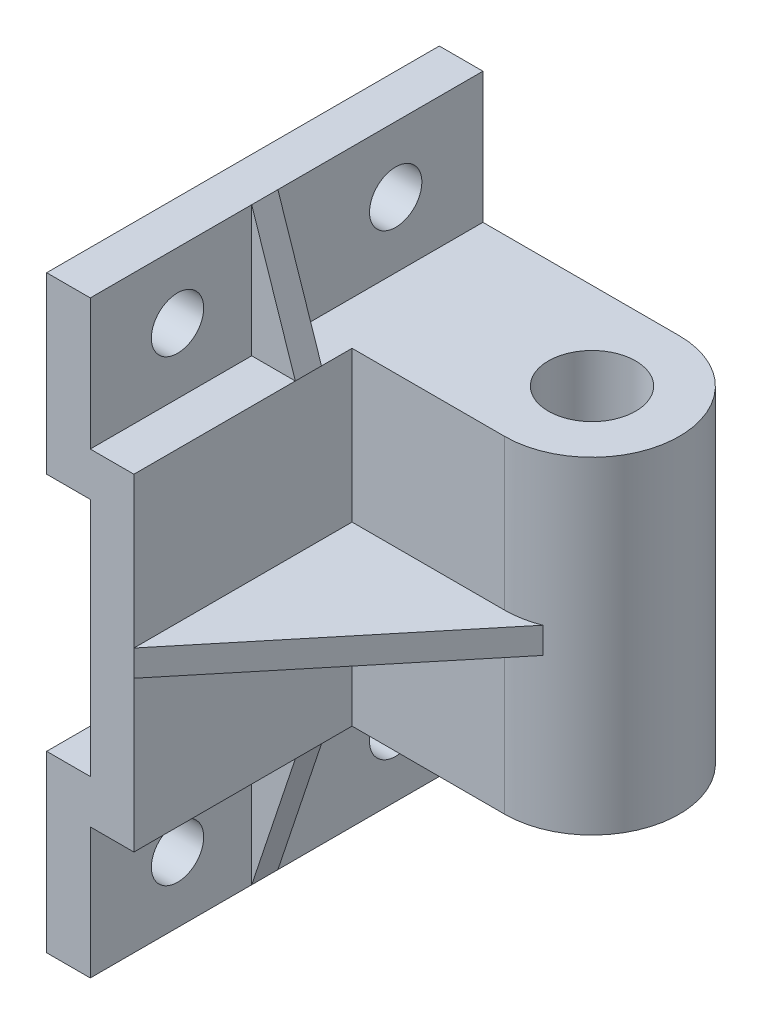
ISO-10303-21;
HEADER;
FILE_DESCRIPTION(('STEP AP214'),'2;1');
FILE_NAME('part.step','',(''),(''),'','','');
FILE_SCHEMA(('AUTOMOTIVE_DESIGN { 1 0 10303 214 1 1 1 1 }'));
ENDSEC;
DATA;
#1=APPLICATION_CONTEXT('core data for automotive mechanical design processes');
#2=APPLICATION_PROTOCOL_DEFINITION('international standard','automotive_design',2000,#1);
#3=PRODUCT_CONTEXT('',#1,'mechanical');
#4=PRODUCT('Part','Part','',(#3));
#5=PRODUCT_RELATED_PRODUCT_CATEGORY('part','',(#4));
#6=PRODUCT_DEFINITION_FORMATION('','',#4);
#7=PRODUCT_DEFINITION_CONTEXT('part definition',#1,'design');
#8=PRODUCT_DEFINITION('design','',#6,#7);
#9=PRODUCT_DEFINITION_SHAPE('','',#8);
#10=(LENGTH_UNIT() NAMED_UNIT(*) SI_UNIT(.MILLI.,.METRE.));
#11=(NAMED_UNIT(*) PLANE_ANGLE_UNIT() SI_UNIT($,.RADIAN.));
#12=(NAMED_UNIT(*) SI_UNIT($,.STERADIAN.) SOLID_ANGLE_UNIT());
#13=UNCERTAINTY_MEASURE_WITH_UNIT(LENGTH_MEASURE(1.E-05),#10,'distance_accuracy_value','');
#14=(GEOMETRIC_REPRESENTATION_CONTEXT(3) GLOBAL_UNCERTAINTY_ASSIGNED_CONTEXT((#13)) GLOBAL_UNIT_ASSIGNED_CONTEXT((#10,
#11,#12)) REPRESENTATION_CONTEXT('',''));
#15=CARTESIAN_POINT('',(0.,0.,0.));
#16=DIRECTION('',(0.,0.,1.));
#17=DIRECTION('',(1.,0.,0.));
#18=AXIS2_PLACEMENT_3D('',#15,#16,#17);
#19=CARTESIAN_POINT('',(0.,0.,-45.));
#20=DIRECTION('',(1.,0.,0.));
#21=DIRECTION('',(0.,1.,0.));
#22=AXIS2_PLACEMENT_3D('',#19,#20,#21);
#23=PLANE('',#22);
#24=DIRECTION('',(0.,1.,0.));
#25=VECTOR('',#24,1.);
#26=CARTESIAN_POINT('',(0.,0.,45.));
#27=LINE('',#26,#25);
#28=CARTESIAN_POINT('',(0.,-34.5,45.));
#29=VERTEX_POINT('',#28);
#30=CARTESIAN_POINT('',(0.,0.,45.));
#31=VERTEX_POINT('',#30);
#32=EDGE_CURVE('E48',#29,#31,#27,.T.);
#33=ORIENTED_EDGE('',*,*,#32,.F.);
#34=DIRECTION('',(0.,0.,1.));
#35=VECTOR('',#34,1.);
#36=CARTESIAN_POINT('',(0.,-34.5,45.));
#37=LINE('',#36,#35);
#38=CARTESIAN_POINT('',(0.,-34.5,-4.99999999999999));
#39=VERTEX_POINT('',#38);
#40=EDGE_CURVE('E216',#39,#29,#37,.T.);
#41=ORIENTED_EDGE('',*,*,#40,.F.);
#42=DIRECTION('',(0.,1.,0.));
#43=VECTOR('',#42,1.);
#44=CARTESIAN_POINT('',(0.,-143.007352543677,-4.99999999999999));
#45=LINE('',#44,#43);
#46=CARTESIAN_POINT('',(0.,0.,-5.));
#47=VERTEX_POINT('',#46);
#48=EDGE_CURVE('E316',#39,#47,#45,.T.);
#49=ORIENTED_EDGE('',*,*,#48,.T.);
#50=DIRECTION('',(0.,0.,1.));
#51=VECTOR('',#50,1.);
#52=CARTESIAN_POINT('',(0.,0.,-45.));
#53=LINE('',#52,#51);
#54=CARTESIAN_POINT('',(0.,0.,1.99999999999999));
#55=VERTEX_POINT('',#54);
#56=EDGE_CURVE('E403',#47,#55,#53,.T.);
#57=ORIENTED_EDGE('',*,*,#56,.T.);
#58=DIRECTION('',(0.,0.,1.));
#59=VECTOR('',#58,1.);
#60=CARTESIAN_POINT('',(0.,0.,2.));
#61=LINE('',#60,#59);
#62=CARTESIAN_POINT('',(0.,0.,8.));
#63=VERTEX_POINT('',#62);
#64=EDGE_CURVE('E257',#55,#63,#61,.T.);
#65=ORIENTED_EDGE('',*,*,#64,.T.);
#66=EDGE_CURVE('E406',#63,#31,#53,.T.);
#67=ORIENTED_EDGE('',*,*,#66,.T.);
#68=EDGE_LOOP('',(#33,#41,#49,#57,#65,#67));
#69=FACE_BOUND('',#68,.T.);
#70=ADVANCED_FACE('F33',(#69),#23,.T.);
#71=CARTESIAN_POINT('',(0.,-143.007352543677,-4.99999999999999));
#72=DIRECTION('',(0.,0.,1.));
#73=DIRECTION('',(1.,0.,0.));
#74=AXIS2_PLACEMENT_3D('',#71,#72,#73);
#75=PLANE('',#74);
#76=ORIENTED_EDGE('',*,*,#48,.F.);
#77=DIRECTION('',(1.,0.,0.));
#78=VECTOR('',#77,1.);
#79=CARTESIAN_POINT('',(0.,-34.5,-4.99999999999999));
#80=LINE('',#79,#78);
#81=CARTESIAN_POINT('',(35.,-34.5,-4.99999999999999));
#82=VERTEX_POINT('',#81);
#83=EDGE_CURVE('E226',#39,#82,#80,.T.);
#84=ORIENTED_EDGE('',*,*,#83,.T.);
#85=DIRECTION('',(0.,1.,0.));
#86=VECTOR('',#85,1.);
#87=CARTESIAN_POINT('',(35.,-143.007352543677,-4.99999999999999));
#88=LINE('',#87,#86);
#89=CARTESIAN_POINT('',(35.,0.,-4.99999999999999));
#90=VERTEX_POINT('',#89);
#91=EDGE_CURVE('E308',#82,#90,#88,.T.);
#92=ORIENTED_EDGE('',*,*,#91,.T.);
#93=DIRECTION('',(1.,0.,0.));
#94=VECTOR('',#93,1.);
#95=CARTESIAN_POINT('',(0.,0.,-4.99999999999999));
#96=LINE('',#95,#94);
#97=EDGE_CURVE('E297',#47,#90,#96,.T.);
#98=ORIENTED_EDGE('',*,*,#97,.F.);
#99=EDGE_LOOP('',(#76,#84,#92,#98));
#100=FACE_BOUND('',#99,.T.);
#101=ADVANCED_FACE('F462',(#100),#75,.T.);
#102=CARTESIAN_POINT('',(35.,-143.007352543677,-25.));
#103=DIRECTION('',(0.,1.,0.));
#104=DIRECTION('',(-1.,0.,0.));
#105=AXIS2_PLACEMENT_3D('',#102,#103,#104);
#106=CYLINDRICAL_SURFACE('',#105,20.);
#107=ORIENTED_EDGE('',*,*,#91,.F.);
#108=CARTESIAN_POINT('',(35.,-34.5,-25.));
#109=DIRECTION('',(0.,-1.,0.));
#110=DIRECTION('',(0.,0.,-1.));
#111=AXIS2_PLACEMENT_3D('',#108,#109,#110);
#112=CIRCLE('',#111,20.);
#113=CARTESIAN_POINT('',(42.3375071609035,-34.5,-6.39459786342446));
#114=VERTEX_POINT('',#113);
#115=EDGE_CURVE('E11',#82,#114,#112,.F.);
#116=ORIENTED_EDGE('',*,*,#115,.T.);
#117=DIRECTION('',(0.,1.,0.));
#118=VECTOR('',#117,1.);
#119=CARTESIAN_POINT('',(42.3375071609035,-143.007352543677,-6.39459786342446));
#120=LINE('',#119,#118);
#121=CARTESIAN_POINT('',(42.3375071609036,-40.5,-6.39459786342446));
#122=VERTEX_POINT('',#121);
#123=EDGE_CURVE('E41',#114,#122,#120,.F.);
#124=ORIENTED_EDGE('',*,*,#123,.T.);
#125=CARTESIAN_POINT('',(35.,-40.5,-25.));
#126=DIRECTION('',(0.,-1.,0.));
#127=DIRECTION('',(0.,0.,-1.));
#128=AXIS2_PLACEMENT_3D('',#125,#126,#127);
#129=CIRCLE('',#128,20.);
#130=CARTESIAN_POINT('',(35.,-40.5,-4.99999999999999));
#131=VERTEX_POINT('',#130);
#132=EDGE_CURVE('E198',#131,#122,#129,.F.);
#133=ORIENTED_EDGE('',*,*,#132,.F.);
#134=CARTESIAN_POINT('',(35.,-75.,-4.99999999999999));
#135=VERTEX_POINT('',#134);
#136=EDGE_CURVE('E313',#135,#131,#88,.T.);
#137=ORIENTED_EDGE('',*,*,#136,.F.);
#138=CARTESIAN_POINT('',(35.,-75.,-25.));
#139=DIRECTION('',(0.,-1.,0.));
#140=DIRECTION('',(0.,0.,-1.));
#141=AXIS2_PLACEMENT_3D('',#138,#139,#140);
#142=CIRCLE('',#141,20.);
#143=CARTESIAN_POINT('',(35.,-75.,-45.));
#144=VERTEX_POINT('',#143);
#145=EDGE_CURVE('E309',#135,#144,#142,.F.);
#146=ORIENTED_EDGE('',*,*,#145,.T.);
#147=DIRECTION('',(0.,1.,0.));
#148=VECTOR('',#147,1.);
#149=CARTESIAN_POINT('',(35.,-143.007352543677,-45.));
#150=LINE('',#149,#148);
#151=CARTESIAN_POINT('',(35.,0.,-45.));
#152=VERTEX_POINT('',#151);
#153=EDGE_CURVE('E312',#144,#152,#150,.T.);
#154=ORIENTED_EDGE('',*,*,#153,.T.);
#155=CARTESIAN_POINT('',(35.,0.,-25.));
#156=DIRECTION('',(0.,1.,0.));
#157=DIRECTION('',(-1.,0.,0.));
#158=AXIS2_PLACEMENT_3D('',#155,#156,#157);
#159=CIRCLE('',#158,20.);
#160=EDGE_CURVE('E300',#90,#152,#159,.T.);
#161=ORIENTED_EDGE('',*,*,#160,.F.);
#162=EDGE_LOOP('',(#107,#116,#124,#133,#137,#146,#154,#161));
#163=FACE_BOUND('',#162,.T.);
#164=ADVANCED_FACE('F196',(#163),#106,.T.);
#165=CARTESIAN_POINT('',(0.,-75.,-45.));
#166=DIRECTION('',(0.,-1.,0.));
#167=DIRECTION('',(0.,0.,-1.));
#168=AXIS2_PLACEMENT_3D('',#165,#166,#167);
#169=PLANE('',#168);
#170=CARTESIAN_POINT('',(35.,-75.,-25.));
#171=DIRECTION('',(0.,1.,0.));
#172=DIRECTION('',(-1.,0.,0.));
#173=AXIS2_PLACEMENT_3D('',#170,#171,#172);
#174=CIRCLE('',#173,10.);
#175=CARTESIAN_POINT('',(25.,-75.,-25.));
#176=VERTEX_POINT('',#175);
#177=EDGE_CURVE('E294',#176,#176,#174,.T.);
#178=ORIENTED_EDGE('',*,*,#177,.T.);
#179=EDGE_LOOP('',(#178));
#180=FACE_BOUND('',#179,.T.);
#181=DIRECTION('',(0.,0.,1.));
#182=VECTOR('',#181,1.);
#183=CARTESIAN_POINT('',(0.,-75.,-45.));
#184=LINE('',#183,#182);
#185=CARTESIAN_POINT('',(0.,-75.,-4.99999999999999));
#186=VERTEX_POINT('',#185);
#187=CARTESIAN_POINT('',(0.,-75.,2.));
#188=VERTEX_POINT('',#187);
#189=EDGE_CURVE('E407',#186,#188,#184,.T.);
#190=ORIENTED_EDGE('',*,*,#189,.T.);
#191=DIRECTION('',(1.,0.,0.));
#192=VECTOR('',#191,1.);
#193=CARTESIAN_POINT('',(0.,-75.,2.));
#194=LINE('',#193,#192);
#195=CARTESIAN_POINT('',(-10.,-75.,2.));
#196=VERTEX_POINT('',#195);
#197=EDGE_CURVE('E234',#196,#188,#194,.T.);
#198=ORIENTED_EDGE('',*,*,#197,.F.);
#199=DIRECTION('',(0.,0.,1.));
#200=VECTOR('',#199,1.);
#201=CARTESIAN_POINT('',(-9.99999999999999,-75.,-45.));
#202=LINE('',#201,#200);
#203=CARTESIAN_POINT('',(-9.99999999999999,-75.,-45.));
#204=VERTEX_POINT('',#203);
#205=EDGE_CURVE('E411',#204,#196,#202,.T.);
#206=ORIENTED_EDGE('',*,*,#205,.F.);
#207=DIRECTION('',(1.,0.,0.));
#208=VECTOR('',#207,1.);
#209=CARTESIAN_POINT('',(0.,-75.,-45.));
#210=LINE('',#209,#208);
#211=EDGE_CURVE('E334',#204,#144,#210,.T.);
#212=ORIENTED_EDGE('',*,*,#211,.T.);
#213=ORIENTED_EDGE('',*,*,#145,.F.);
#214=DIRECTION('',(1.,0.,0.));
#215=VECTOR('',#214,1.);
#216=CARTESIAN_POINT('',(0.,-75.,-4.99999999999999));
#217=LINE('',#216,#215);
#218=EDGE_CURVE('E303',#186,#135,#217,.T.);
#219=ORIENTED_EDGE('',*,*,#218,.F.);
#220=EDGE_LOOP('',(#190,#198,#206,#212,#213,#219));
#221=FACE_BOUND('',#220,.T.);
#222=ADVANCED_FACE('F483',(#180,#221),#169,.T.);
#223=CARTESIAN_POINT('',(-9.99999999999999,-75.,-45.));
#224=DIRECTION('',(1.,0.,0.));
#225=DIRECTION('',(0.,1.,0.));
#226=AXIS2_PLACEMENT_3D('',#223,#224,#225);
#227=PLANE('',#226);
#228=CARTESIAN_POINT('',(-10.,-90.,-25.));
#229=DIRECTION('',(-1.,0.,0.));
#230=DIRECTION('',(0.,-1.,0.));
#231=AXIS2_PLACEMENT_3D('',#228,#229,#230);
#232=CIRCLE('',#231,6.);
#233=CARTESIAN_POINT('',(-10.,-96.,-25.));
#234=VERTEX_POINT('',#233);
#235=EDGE_CURVE('E268',#234,#234,#232,.T.);
#236=ORIENTED_EDGE('',*,*,#235,.T.);
#237=EDGE_LOOP('',(#236));
#238=FACE_BOUND('',#237,.T.);
#239=ORIENTED_EDGE('',*,*,#205,.T.);
#240=DIRECTION('',(0.,1.,0.));
#241=VECTOR('',#240,1.);
#242=CARTESIAN_POINT('',(-10.,-75.,2.));
#243=LINE('',#242,#241);
#244=CARTESIAN_POINT('',(-9.99999999999999,-105.,2.));
#245=VERTEX_POINT('',#244);
#246=EDGE_CURVE('E229',#245,#196,#243,.T.);
#247=ORIENTED_EDGE('',*,*,#246,.F.);
#248=DIRECTION('',(0.,0.,1.));
#249=VECTOR('',#248,1.);
#250=CARTESIAN_POINT('',(-9.99999999999999,-105.,-45.));
#251=LINE('',#250,#249);
#252=CARTESIAN_POINT('',(-9.99999999999999,-105.,-45.));
#253=VERTEX_POINT('',#252);
#254=EDGE_CURVE('E415',#253,#245,#251,.T.);
#255=ORIENTED_EDGE('',*,*,#254,.F.);
#256=DIRECTION('',(0.,1.,0.));
#257=VECTOR('',#256,1.);
#258=CARTESIAN_POINT('',(-9.99999999999999,-75.,-45.));
#259=LINE('',#258,#257);
#260=EDGE_CURVE('E331',#253,#204,#259,.T.);
#261=ORIENTED_EDGE('',*,*,#260,.T.);
#262=EDGE_LOOP('',(#239,#247,#255,#261));
#263=FACE_BOUND('',#262,.T.);
#264=ADVANCED_FACE('F487',(#238,#263),#227,.T.);
#265=CARTESIAN_POINT('',(-10.,0.,-45.));
#266=DIRECTION('',(1.,0.,0.));
#267=DIRECTION('',(0.,1.,0.));
#268=AXIS2_PLACEMENT_3D('',#265,#266,#267);
#269=PLANE('',#268);
#270=CARTESIAN_POINT('',(-10.,15.,-25.));
#271=DIRECTION('',(1.,0.,0.));
#272=DIRECTION('',(0.,1.,0.));
#273=AXIS2_PLACEMENT_3D('',#270,#271,#272);
#274=CIRCLE('',#273,6.);
#275=CARTESIAN_POINT('',(-10.,21.,-25.));
#276=VERTEX_POINT('',#275);
#277=EDGE_CURVE('E273',#276,#276,#274,.T.);
#278=ORIENTED_EDGE('',*,*,#277,.F.);
#279=EDGE_LOOP('',(#278));
#280=FACE_BOUND('',#279,.T.);
#281=DIRECTION('',(0.,0.,1.));
#282=VECTOR('',#281,1.);
#283=CARTESIAN_POINT('',(-9.99999999999999,30.,-45.));
#284=LINE('',#283,#282);
#285=CARTESIAN_POINT('',(-9.99999999999999,30.,-45.));
#286=VERTEX_POINT('',#285);
#287=CARTESIAN_POINT('',(-9.99999999999999,30.,1.99999999999999));
#288=VERTEX_POINT('',#287);
#289=EDGE_CURVE('E395',#286,#288,#284,.T.);
#290=ORIENTED_EDGE('',*,*,#289,.T.);
#291=DIRECTION('',(0.,-1.,0.));
#292=VECTOR('',#291,1.);
#293=CARTESIAN_POINT('',(-10.,0.,2.));
#294=LINE('',#293,#292);
#295=CARTESIAN_POINT('',(-10.,0.,1.99999999999999));
#296=VERTEX_POINT('',#295);
#297=EDGE_CURVE('E249',#288,#296,#294,.T.);
#298=ORIENTED_EDGE('',*,*,#297,.T.);
#299=DIRECTION('',(0.,0.,1.));
#300=VECTOR('',#299,1.);
#301=CARTESIAN_POINT('',(-10.,0.,-45.));
#302=LINE('',#301,#300);
#303=CARTESIAN_POINT('',(-10.,0.,-45.));
#304=VERTEX_POINT('',#303);
#305=EDGE_CURVE('E399',#304,#296,#302,.T.);
#306=ORIENTED_EDGE('',*,*,#305,.F.);
#307=DIRECTION('',(0.,1.,0.));
#308=VECTOR('',#307,1.);
#309=CARTESIAN_POINT('',(-10.,0.,-45.));
#310=LINE('',#309,#308);
#311=EDGE_CURVE('E339',#304,#286,#310,.T.);
#312=ORIENTED_EDGE('',*,*,#311,.T.);
#313=EDGE_LOOP('',(#290,#298,#306,#312));
#314=FACE_BOUND('',#313,.T.);
#315=ADVANCED_FACE('F478',(#280,#314),#269,.T.);
#316=CARTESIAN_POINT('',(0.,0.,-45.));
#317=DIRECTION('',(0.,1.,0.));
#318=DIRECTION('',(-1.,0.,0.));
#319=AXIS2_PLACEMENT_3D('',#316,#317,#318);
#320=PLANE('',#319);
#321=CARTESIAN_POINT('',(35.,0.,-25.));
#322=DIRECTION('',(0.,1.,0.));
#323=DIRECTION('',(-1.,0.,0.));
#324=AXIS2_PLACEMENT_3D('',#321,#322,#323);
#325=CIRCLE('',#324,10.);
#326=CARTESIAN_POINT('',(25.,0.,-25.));
#327=VERTEX_POINT('',#326);
#328=EDGE_CURVE('E285',#327,#327,#325,.T.);
#329=ORIENTED_EDGE('',*,*,#328,.F.);
#330=EDGE_LOOP('',(#329));
#331=FACE_BOUND('',#330,.T.);
#332=ORIENTED_EDGE('',*,*,#305,.T.);
#333=DIRECTION('',(1.,0.,0.));
#334=VECTOR('',#333,1.);
#335=CARTESIAN_POINT('',(0.,0.,2.));
#336=LINE('',#335,#334);
#337=EDGE_CURVE('E251',#296,#55,#336,.T.);
#338=ORIENTED_EDGE('',*,*,#337,.T.);
#339=ORIENTED_EDGE('',*,*,#56,.F.);
#340=ORIENTED_EDGE('',*,*,#97,.T.);
#341=ORIENTED_EDGE('',*,*,#160,.T.);
#342=DIRECTION('',(-1.,0.,0.));
#343=VECTOR('',#342,1.);
#344=CARTESIAN_POINT('',(0.,0.,-45.));
#345=LINE('',#344,#343);
#346=EDGE_CURVE('E336',#152,#304,#345,.T.);
#347=ORIENTED_EDGE('',*,*,#346,.T.);
#348=EDGE_LOOP('',(#332,#338,#339,#340,#341,#347));
#349=FACE_BOUND('',#348,.T.);
#350=ADVANCED_FACE('F466',(#331,#349),#320,.T.);
#351=DIRECTION('',(0.,0.,1.));
#352=VECTOR('',#351,1.);
#353=CARTESIAN_POINT('',(0.,-40.5,45.));
#354=LINE('',#353,#352);
#355=CARTESIAN_POINT('',(0.,-40.5,-4.99999999999999));
#356=VERTEX_POINT('',#355);
#357=CARTESIAN_POINT('',(0.,-40.5,45.));
#358=VERTEX_POINT('',#357);
#359=EDGE_CURVE('E56',#356,#358,#354,.T.);
#360=ORIENTED_EDGE('',*,*,#359,.T.);
#361=CARTESIAN_POINT('',(0.,-75.,45.));
#362=VERTEX_POINT('',#361);
#363=EDGE_CURVE('E369',#362,#358,#27,.T.);
#364=ORIENTED_EDGE('',*,*,#363,.F.);
#365=CARTESIAN_POINT('',(0.,-75.,8.));
#366=VERTEX_POINT('',#365);
#367=EDGE_CURVE('E410',#366,#362,#184,.T.);
#368=ORIENTED_EDGE('',*,*,#367,.F.);
#369=DIRECTION('',(0.,0.,1.));
#370=VECTOR('',#369,1.);
#371=CARTESIAN_POINT('',(0.,-75.,2.));
#372=LINE('',#371,#370);
#373=EDGE_CURVE('E244',#188,#366,#372,.T.);
#374=ORIENTED_EDGE('',*,*,#373,.F.);
#375=ORIENTED_EDGE('',*,*,#189,.F.);
#376=EDGE_CURVE('E318',#186,#356,#45,.T.);
#377=ORIENTED_EDGE('',*,*,#376,.T.);
#378=EDGE_LOOP('',(#360,#364,#368,#374,#375,#377));
#379=FACE_BOUND('',#378,.T.);
#380=ADVANCED_FACE('F455',(#379),#23,.T.);
#381=CARTESIAN_POINT('',(-9.99999999999999,-65.,-45.));
#382=DIRECTION('',(0.,1.,0.));
#383=DIRECTION('',(-1.,0.,0.));
#384=AXIS2_PLACEMENT_3D('',#381,#382,#383);
#385=PLANE('',#384);
#386=DIRECTION('',(-1.,0.,0.));
#387=VECTOR('',#386,1.);
#388=CARTESIAN_POINT('',(-9.99999999999999,-65.,45.));
#389=LINE('',#388,#387);
#390=CARTESIAN_POINT('',(-9.99999999999999,-65.,45.));
#391=VERTEX_POINT('',#390);
#392=CARTESIAN_POINT('',(-20.,-65.,45.));
#393=VERTEX_POINT('',#392);
#394=EDGE_CURVE('E320',#391,#393,#389,.T.);
#395=ORIENTED_EDGE('',*,*,#394,.F.);
#396=DIRECTION('',(0.,0.,1.));
#397=VECTOR('',#396,1.);
#398=CARTESIAN_POINT('',(-9.99999999999999,-65.,-45.));
#399=LINE('',#398,#397);
#400=CARTESIAN_POINT('',(-9.99999999999999,-65.,-45.));
#401=VERTEX_POINT('',#400);
#402=EDGE_CURVE('E212',#401,#391,#399,.T.);
#403=ORIENTED_EDGE('',*,*,#402,.F.);
#404=DIRECTION('',(-1.,0.,0.));
#405=VECTOR('',#404,1.);
#406=CARTESIAN_POINT('',(-9.99999999999999,-65.,-45.));
#407=LINE('',#406,#405);
#408=CARTESIAN_POINT('',(-20.,-65.,-45.));
#409=VERTEX_POINT('',#408);
#410=EDGE_CURVE('E321',#401,#409,#407,.T.);
#411=ORIENTED_EDGE('',*,*,#410,.T.);
#412=DIRECTION('',(0.,0.,1.));
#413=VECTOR('',#412,1.);
#414=CARTESIAN_POINT('',(-20.,-65.,-45.));
#415=LINE('',#414,#413);
#416=EDGE_CURVE('E354',#409,#393,#415,.T.);
#417=ORIENTED_EDGE('',*,*,#416,.T.);
#418=EDGE_LOOP('',(#395,#403,#411,#417));
#419=FACE_BOUND('',#418,.T.);
#420=ADVANCED_FACE('F35',(#419),#385,.T.);
#421=CARTESIAN_POINT('',(-10.,-10.,-45.));
#422=DIRECTION('',(-1.,0.,0.));
#423=DIRECTION('',(0.,-1.,0.));
#424=AXIS2_PLACEMENT_3D('',#421,#422,#423);
#425=PLANE('',#424);
#426=DIRECTION('',(0.,-1.,0.));
#427=VECTOR('',#426,1.);
#428=CARTESIAN_POINT('',(-10.,-10.,45.));
#429=LINE('',#428,#427);
#430=CARTESIAN_POINT('',(-10.,-10.,45.));
#431=VERTEX_POINT('',#430);
#432=EDGE_CURVE('E325',#431,#391,#429,.T.);
#433=ORIENTED_EDGE('',*,*,#432,.F.);
#434=DIRECTION('',(0.,0.,1.));
#435=VECTOR('',#434,1.);
#436=CARTESIAN_POINT('',(-10.,-10.,-45.));
#437=LINE('',#436,#435);
#438=CARTESIAN_POINT('',(-10.,-10.,-45.));
#439=VERTEX_POINT('',#438);
#440=EDGE_CURVE('E389',#439,#431,#437,.T.);
#441=ORIENTED_EDGE('',*,*,#440,.F.);
#442=DIRECTION('',(0.,-1.,0.));
#443=VECTOR('',#442,1.);
#444=CARTESIAN_POINT('',(-10.,-10.,-45.));
#445=LINE('',#444,#443);
#446=EDGE_CURVE('E351',#439,#401,#445,.T.);
#447=ORIENTED_EDGE('',*,*,#446,.T.);
#448=ORIENTED_EDGE('',*,*,#402,.T.);
#449=EDGE_LOOP('',(#433,#441,#447,#448));
#450=FACE_BOUND('',#449,.T.);
#451=ADVANCED_FACE('F434',(#450),#425,.T.);
#452=CARTESIAN_POINT('',(-10.,-10.,-45.));
#453=DIRECTION('',(0.,-1.,0.));
#454=DIRECTION('',(1.,0.,0.));
#455=AXIS2_PLACEMENT_3D('',#452,#453,#454);
#456=PLANE('',#455);
#457=DIRECTION('',(1.,0.,0.));
#458=VECTOR('',#457,1.);
#459=CARTESIAN_POINT('',(-10.,-10.,45.));
#460=LINE('',#459,#458);
#461=CARTESIAN_POINT('',(-20.,-10.,45.));
#462=VERTEX_POINT('',#461);
#463=EDGE_CURVE('E383',#462,#431,#460,.T.);
#464=ORIENTED_EDGE('',*,*,#463,.F.);
#465=DIRECTION('',(0.,0.,1.));
#466=VECTOR('',#465,1.);
#467=CARTESIAN_POINT('',(-20.,-10.,-45.));
#468=LINE('',#467,#466);
#469=CARTESIAN_POINT('',(-20.,-10.,-45.));
#470=VERTEX_POINT('',#469);
#471=EDGE_CURVE('E391',#470,#462,#468,.T.);
#472=ORIENTED_EDGE('',*,*,#471,.F.);
#473=DIRECTION('',(1.,0.,0.));
#474=VECTOR('',#473,1.);
#475=CARTESIAN_POINT('',(-10.,-10.,-45.));
#476=LINE('',#475,#474);
#477=EDGE_CURVE('E348',#470,#439,#476,.T.);
#478=ORIENTED_EDGE('',*,*,#477,.T.);
#479=ORIENTED_EDGE('',*,*,#440,.T.);
#480=EDGE_LOOP('',(#464,#472,#478,#479));
#481=FACE_BOUND('',#480,.T.);
#482=ADVANCED_FACE('F586',(#481),#456,.T.);
#483=CARTESIAN_POINT('',(-20.,-10.,-45.));
#484=DIRECTION('',(-1.,0.,0.));
#485=DIRECTION('',(0.,0.,1.));
#486=AXIS2_PLACEMENT_3D('',#483,#484,#485);
#487=PLANE('',#486);
#488=CARTESIAN_POINT('',(-20.,15.,25.));
#489=DIRECTION('',(1.,0.,0.));
#490=DIRECTION('',(0.,1.,0.));
#491=AXIS2_PLACEMENT_3D('',#488,#489,#490);
#492=CIRCLE('',#491,6.);
#493=CARTESIAN_POINT('',(-20.,21.,25.));
#494=VERTEX_POINT('',#493);
#495=EDGE_CURVE('E282',#494,#494,#492,.T.);
#496=ORIENTED_EDGE('',*,*,#495,.T.);
#497=EDGE_LOOP('',(#496));
#498=FACE_BOUND('',#497,.T.);
#499=CARTESIAN_POINT('',(-20.,15.,-25.));
#500=DIRECTION('',(1.,0.,0.));
#501=DIRECTION('',(0.,1.,0.));
#502=AXIS2_PLACEMENT_3D('',#499,#500,#501);
#503=CIRCLE('',#502,6.);
#504=CARTESIAN_POINT('',(-20.,21.,-25.));
#505=VERTEX_POINT('',#504);
#506=EDGE_CURVE('E289',#505,#505,#503,.T.);
#507=ORIENTED_EDGE('',*,*,#506,.T.);
#508=EDGE_LOOP('',(#507));
#509=FACE_BOUND('',#508,.T.);
#510=DIRECTION('',(0.,-1.,0.));
#511=VECTOR('',#510,1.);
#512=CARTESIAN_POINT('',(-20.,-10.,45.));
#513=LINE('',#512,#511);
#514=CARTESIAN_POINT('',(-20.,30.,45.));
#515=VERTEX_POINT('',#514);
#516=EDGE_CURVE('E380',#515,#462,#513,.T.);
#517=ORIENTED_EDGE('',*,*,#516,.F.);
#518=DIRECTION('',(0.,0.,1.));
#519=VECTOR('',#518,1.);
#520=CARTESIAN_POINT('',(-20.,30.,-45.));
#521=LINE('',#520,#519);
#522=CARTESIAN_POINT('',(-20.,30.,-45.));
#523=VERTEX_POINT('',#522);
#524=EDGE_CURVE('E393',#523,#515,#521,.T.);
#525=ORIENTED_EDGE('',*,*,#524,.F.);
#526=DIRECTION('',(0.,-1.,0.));
#527=VECTOR('',#526,1.);
#528=CARTESIAN_POINT('',(-20.,-10.,-45.));
#529=LINE('',#528,#527);
#530=EDGE_CURVE('E345',#523,#470,#529,.T.);
#531=ORIENTED_EDGE('',*,*,#530,.T.);
#532=ORIENTED_EDGE('',*,*,#471,.T.);
#533=EDGE_LOOP('',(#517,#525,#531,#532));
#534=FACE_BOUND('',#533,.T.);
#535=ADVANCED_FACE('F589',(#498,#509,#534),#487,.T.);
#536=CARTESIAN_POINT('',(-20.,30.,-45.));
#537=DIRECTION('',(0.,1.,0.));
#538=DIRECTION('',(0.,0.,1.));
#539=AXIS2_PLACEMENT_3D('',#536,#537,#538);
#540=PLANE('',#539);
#541=DIRECTION('',(-1.,0.,0.));
#542=VECTOR('',#541,1.);
#543=CARTESIAN_POINT('',(-20.,30.,45.));
#544=LINE('',#543,#542);
#545=CARTESIAN_POINT('',(-9.99999999999999,30.,45.));
#546=VERTEX_POINT('',#545);
#547=EDGE_CURVE('E377',#546,#515,#544,.T.);
#548=ORIENTED_EDGE('',*,*,#547,.F.);
#549=CARTESIAN_POINT('',(-9.99999999999999,30.,7.99999999999999));
#550=VERTEX_POINT('',#549);
#551=EDGE_CURVE('E398',#550,#546,#284,.T.);
#552=ORIENTED_EDGE('',*,*,#551,.F.);
#553=DIRECTION('',(0.,0.,1.));
#554=VECTOR('',#553,1.);
#555=CARTESIAN_POINT('',(-9.99999999999999,30.,2.));
#556=LINE('',#555,#554);
#557=EDGE_CURVE('E265',#288,#550,#556,.T.);
#558=ORIENTED_EDGE('',*,*,#557,.F.);
#559=ORIENTED_EDGE('',*,*,#289,.F.);
#560=DIRECTION('',(-1.,0.,0.));
#561=VECTOR('',#560,1.);
#562=CARTESIAN_POINT('',(-20.,30.,-45.));
#563=LINE('',#562,#561);
#564=EDGE_CURVE('E342',#286,#523,#563,.T.);
#565=ORIENTED_EDGE('',*,*,#564,.T.);
#566=ORIENTED_EDGE('',*,*,#524,.T.);
#567=EDGE_LOOP('',(#548,#552,#558,#559,#565,#566));
#568=FACE_BOUND('',#567,.T.);
#569=ADVANCED_FACE('F537',(#568),#540,.T.);
#570=DIRECTION('',(0.,-1.,0.));
#571=VECTOR('',#570,1.);
#572=CARTESIAN_POINT('',(-10.,0.,8.));
#573=LINE('',#572,#571);
#574=CARTESIAN_POINT('',(-10.,0.,7.99999999999999));
#575=VERTEX_POINT('',#574);
#576=EDGE_CURVE('E246',#550,#575,#573,.T.);
#577=ORIENTED_EDGE('',*,*,#576,.F.);
#578=ORIENTED_EDGE('',*,*,#551,.T.);
#579=DIRECTION('',(0.,1.,0.));
#580=VECTOR('',#579,1.);
#581=CARTESIAN_POINT('',(-10.,0.,45.));
#582=LINE('',#581,#580);
#583=CARTESIAN_POINT('',(-10.,0.,45.));
#584=VERTEX_POINT('',#583);
#585=EDGE_CURVE('E374',#584,#546,#582,.T.);
#586=ORIENTED_EDGE('',*,*,#585,.F.);
#587=EDGE_CURVE('E402',#575,#584,#302,.T.);
#588=ORIENTED_EDGE('',*,*,#587,.F.);
#589=EDGE_LOOP('',(#577,#578,#586,#588));
#590=FACE_BOUND('',#589,.T.);
#591=CARTESIAN_POINT('',(-10.,15.,25.));
#592=DIRECTION('',(1.,0.,0.));
#593=DIRECTION('',(0.,1.,0.));
#594=AXIS2_PLACEMENT_3D('',#591,#592,#593);
#595=CIRCLE('',#594,6.);
#596=CARTESIAN_POINT('',(-10.,21.,25.));
#597=VERTEX_POINT('',#596);
#598=EDGE_CURVE('E286',#597,#597,#595,.T.);
#599=ORIENTED_EDGE('',*,*,#598,.F.);
#600=EDGE_LOOP('',(#599));
#601=FACE_BOUND('',#600,.T.);
#602=ADVANCED_FACE('F529',(#590,#601),#269,.T.);
#603=DIRECTION('',(1.,0.,0.));
#604=VECTOR('',#603,1.);
#605=CARTESIAN_POINT('',(0.,0.,8.));
#606=LINE('',#605,#604);
#607=EDGE_CURVE('E260',#575,#63,#606,.T.);
#608=ORIENTED_EDGE('',*,*,#607,.F.);
#609=ORIENTED_EDGE('',*,*,#587,.T.);
#610=DIRECTION('',(-1.,0.,0.));
#611=VECTOR('',#610,1.);
#612=CARTESIAN_POINT('',(0.,0.,45.));
#613=LINE('',#612,#611);
#614=EDGE_CURVE('E371',#31,#584,#613,.T.);
#615=ORIENTED_EDGE('',*,*,#614,.F.);
#616=ORIENTED_EDGE('',*,*,#66,.F.);
#617=EDGE_LOOP('',(#608,#609,#615,#616));
#618=FACE_BOUND('',#617,.T.);
#619=ADVANCED_FACE('F523',(#618),#320,.T.);
#620=DIRECTION('',(1.,0.,0.));
#621=VECTOR('',#620,1.);
#622=CARTESIAN_POINT('',(0.,-75.,8.));
#623=LINE('',#622,#621);
#624=CARTESIAN_POINT('',(-10.,-75.,8.));
#625=VERTEX_POINT('',#624);
#626=EDGE_CURVE('E232',#625,#366,#623,.T.);
#627=ORIENTED_EDGE('',*,*,#626,.T.);
#628=ORIENTED_EDGE('',*,*,#367,.T.);
#629=DIRECTION('',(1.,0.,0.));
#630=VECTOR('',#629,1.);
#631=CARTESIAN_POINT('',(0.,-75.,45.));
#632=LINE('',#631,#630);
#633=CARTESIAN_POINT('',(-9.99999999999999,-75.,45.));
#634=VERTEX_POINT('',#633);
#635=EDGE_CURVE('E366',#634,#362,#632,.T.);
#636=ORIENTED_EDGE('',*,*,#635,.F.);
#637=EDGE_CURVE('E414',#625,#634,#202,.T.);
#638=ORIENTED_EDGE('',*,*,#637,.F.);
#639=EDGE_LOOP('',(#627,#628,#636,#638));
#640=FACE_BOUND('',#639,.T.);
#641=ADVANCED_FACE('F452',(#640),#169,.T.);
#642=DIRECTION('',(0.,1.,0.));
#643=VECTOR('',#642,1.);
#644=CARTESIAN_POINT('',(-10.,-75.,8.));
#645=LINE('',#644,#643);
#646=CARTESIAN_POINT('',(-9.99999999999999,-105.,7.99999999999999));
#647=VERTEX_POINT('',#646);
#648=EDGE_CURVE('E228',#647,#625,#645,.T.);
#649=ORIENTED_EDGE('',*,*,#648,.T.);
#650=ORIENTED_EDGE('',*,*,#637,.T.);
#651=DIRECTION('',(0.,1.,0.));
#652=VECTOR('',#651,1.);
#653=CARTESIAN_POINT('',(-9.99999999999999,-75.,45.));
#654=LINE('',#653,#652);
#655=CARTESIAN_POINT('',(-9.99999999999999,-105.,45.));
#656=VERTEX_POINT('',#655);
#657=EDGE_CURVE('E363',#656,#634,#654,.T.);
#658=ORIENTED_EDGE('',*,*,#657,.F.);
#659=EDGE_CURVE('E418',#647,#656,#251,.T.);
#660=ORIENTED_EDGE('',*,*,#659,.F.);
#661=EDGE_LOOP('',(#649,#650,#658,#660));
#662=FACE_BOUND('',#661,.T.);
#663=CARTESIAN_POINT('',(-10.,-90.,25.));
#664=DIRECTION('',(-1.,0.,0.));
#665=DIRECTION('',(0.,-1.,0.));
#666=AXIS2_PLACEMENT_3D('',#663,#664,#665);
#667=CIRCLE('',#666,6.);
#668=CARTESIAN_POINT('',(-10.,-96.,25.));
#669=VERTEX_POINT('',#668);
#670=EDGE_CURVE('E274',#669,#669,#667,.T.);
#671=ORIENTED_EDGE('',*,*,#670,.T.);
#672=EDGE_LOOP('',(#671));
#673=FACE_BOUND('',#672,.T.);
#674=ADVANCED_FACE('F448',(#662,#673),#227,.T.);
#675=CARTESIAN_POINT('',(-20.,-105.,-45.));
#676=DIRECTION('',(0.,-1.,0.));
#677=DIRECTION('',(0.,0.,-1.));
#678=AXIS2_PLACEMENT_3D('',#675,#676,#677);
#679=PLANE('',#678);
#680=DIRECTION('',(1.,0.,0.));
#681=VECTOR('',#680,1.);
#682=CARTESIAN_POINT('',(-20.,-105.,45.));
#683=LINE('',#682,#681);
#684=CARTESIAN_POINT('',(-20.,-105.,45.));
#685=VERTEX_POINT('',#684);
#686=EDGE_CURVE('E360',#685,#656,#683,.T.);
#687=ORIENTED_EDGE('',*,*,#686,.F.);
#688=DIRECTION('',(0.,0.,1.));
#689=VECTOR('',#688,1.);
#690=CARTESIAN_POINT('',(-20.,-105.,-45.));
#691=LINE('',#690,#689);
#692=CARTESIAN_POINT('',(-20.,-105.,-45.));
#693=VERTEX_POINT('',#692);
#694=EDGE_CURVE('E419',#693,#685,#691,.T.);
#695=ORIENTED_EDGE('',*,*,#694,.F.);
#696=DIRECTION('',(1.,0.,0.));
#697=VECTOR('',#696,1.);
#698=CARTESIAN_POINT('',(-20.,-105.,-45.));
#699=LINE('',#698,#697);
#700=EDGE_CURVE('E328',#693,#253,#699,.T.);
#701=ORIENTED_EDGE('',*,*,#700,.T.);
#702=ORIENTED_EDGE('',*,*,#254,.T.);
#703=DIRECTION('',(0.,0.,1.));
#704=VECTOR('',#703,1.);
#705=CARTESIAN_POINT('',(-9.99999999999999,-105.,2.));
#706=LINE('',#705,#704);
#707=EDGE_CURVE('E236',#245,#647,#706,.T.);
#708=ORIENTED_EDGE('',*,*,#707,.T.);
#709=ORIENTED_EDGE('',*,*,#659,.T.);
#710=EDGE_LOOP('',(#687,#695,#701,#702,#708,#709));
#711=FACE_BOUND('',#710,.T.);
#712=ADVANCED_FACE('F443',(#711),#679,.T.);
#713=CARTESIAN_POINT('',(-20.,-65.,-45.));
#714=DIRECTION('',(-1.,0.,0.));
#715=DIRECTION('',(0.,-1.,0.));
#716=AXIS2_PLACEMENT_3D('',#713,#714,#715);
#717=PLANE('',#716);
#718=CARTESIAN_POINT('',(-20.,-90.,25.));
#719=DIRECTION('',(-1.,0.,0.));
#720=DIRECTION('',(0.,-1.,0.));
#721=AXIS2_PLACEMENT_3D('',#718,#719,#720);
#722=CIRCLE('',#721,6.);
#723=CARTESIAN_POINT('',(-20.,-96.,25.));
#724=VERTEX_POINT('',#723);
#725=EDGE_CURVE('E270',#724,#724,#722,.T.);
#726=ORIENTED_EDGE('',*,*,#725,.F.);
#727=EDGE_LOOP('',(#726));
#728=FACE_BOUND('',#727,.T.);
#729=CARTESIAN_POINT('',(-20.,-90.,-25.));
#730=DIRECTION('',(-1.,0.,0.));
#731=DIRECTION('',(0.,-1.,0.));
#732=AXIS2_PLACEMENT_3D('',#729,#730,#731);
#733=CIRCLE('',#732,6.);
#734=CARTESIAN_POINT('',(-20.,-96.,-25.));
#735=VERTEX_POINT('',#734);
#736=EDGE_CURVE('E277',#735,#735,#733,.T.);
#737=ORIENTED_EDGE('',*,*,#736,.F.);
#738=EDGE_LOOP('',(#737));
#739=FACE_BOUND('',#738,.T.);
#740=DIRECTION('',(0.,-1.,0.));
#741=VECTOR('',#740,1.);
#742=CARTESIAN_POINT('',(-20.,-65.,45.));
#743=LINE('',#742,#741);
#744=EDGE_CURVE('E357',#393,#685,#743,.T.);
#745=ORIENTED_EDGE('',*,*,#744,.F.);
#746=ORIENTED_EDGE('',*,*,#416,.F.);
#747=DIRECTION('',(0.,-1.,0.));
#748=VECTOR('',#747,1.);
#749=CARTESIAN_POINT('',(-20.,-65.,-45.));
#750=LINE('',#749,#748);
#751=EDGE_CURVE('E324',#409,#693,#750,.T.);
#752=ORIENTED_EDGE('',*,*,#751,.T.);
#753=ORIENTED_EDGE('',*,*,#694,.T.);
#754=EDGE_LOOP('',(#745,#746,#752,#753));
#755=FACE_BOUND('',#754,.T.);
#756=ADVANCED_FACE('F427',(#728,#739,#755),#717,.T.);
#757=CARTESIAN_POINT('',(0.,0.,-45.));
#758=DIRECTION('',(0.,0.,1.));
#759=DIRECTION('',(1.,0.,0.));
#760=AXIS2_PLACEMENT_3D('',#757,#758,#759);
#761=PLANE('',#760);
#762=ORIENTED_EDGE('',*,*,#410,.F.);
#763=ORIENTED_EDGE('',*,*,#446,.F.);
#764=ORIENTED_EDGE('',*,*,#477,.F.);
#765=ORIENTED_EDGE('',*,*,#530,.F.);
#766=ORIENTED_EDGE('',*,*,#564,.F.);
#767=ORIENTED_EDGE('',*,*,#311,.F.);
#768=ORIENTED_EDGE('',*,*,#346,.F.);
#769=ORIENTED_EDGE('',*,*,#153,.F.);
#770=ORIENTED_EDGE('',*,*,#211,.F.);
#771=ORIENTED_EDGE('',*,*,#260,.F.);
#772=ORIENTED_EDGE('',*,*,#700,.F.);
#773=ORIENTED_EDGE('',*,*,#751,.F.);
#774=EDGE_LOOP('',(#762,#763,#764,#765,#766,#767,#768,#769,#770,#771,#772,#773));
#775=FACE_BOUND('',#774,.T.);
#776=ADVANCED_FACE('F437',(#775),#761,.F.);
#777=CARTESIAN_POINT('',(0.,0.,45.));
#778=DIRECTION('',(0.,0.,1.));
#779=DIRECTION('',(1.,0.,0.));
#780=AXIS2_PLACEMENT_3D('',#777,#778,#779);
#781=PLANE('',#780);
#782=ORIENTED_EDGE('',*,*,#394,.T.);
#783=ORIENTED_EDGE('',*,*,#744,.T.);
#784=ORIENTED_EDGE('',*,*,#686,.T.);
#785=ORIENTED_EDGE('',*,*,#657,.T.);
#786=ORIENTED_EDGE('',*,*,#635,.T.);
#787=ORIENTED_EDGE('',*,*,#363,.T.);
#788=DIRECTION('',(0.,-1.,0.));
#789=VECTOR('',#788,1.);
#790=CARTESIAN_POINT('',(0.,-34.5,45.));
#791=LINE('',#790,#789);
#792=EDGE_CURVE('E215',#29,#358,#791,.T.);
#793=ORIENTED_EDGE('',*,*,#792,.F.);
#794=ORIENTED_EDGE('',*,*,#32,.T.);
#795=ORIENTED_EDGE('',*,*,#614,.T.);
#796=ORIENTED_EDGE('',*,*,#585,.T.);
#797=ORIENTED_EDGE('',*,*,#547,.T.);
#798=ORIENTED_EDGE('',*,*,#516,.T.);
#799=ORIENTED_EDGE('',*,*,#463,.T.);
#800=ORIENTED_EDGE('',*,*,#432,.T.);
#801=EDGE_LOOP('',(#782,#783,#784,#785,#786,#787,#793,#794,#795,#796,#797,#798,#799,#800));
#802=FACE_BOUND('',#801,.T.);
#803=ADVANCED_FACE('F430',(#802),#781,.T.);
#804=DIRECTION('',(1.,0.,0.));
#805=VECTOR('',#804,1.);
#806=CARTESIAN_POINT('',(0.,-40.5,-4.99999999999999));
#807=LINE('',#806,#805);
#808=EDGE_CURVE('E211',#356,#131,#807,.T.);
#809=ORIENTED_EDGE('',*,*,#808,.F.);
#810=ORIENTED_EDGE('',*,*,#376,.F.);
#811=ORIENTED_EDGE('',*,*,#218,.T.);
#812=ORIENTED_EDGE('',*,*,#136,.T.);
#813=EDGE_LOOP('',(#809,#810,#811,#812));
#814=FACE_BOUND('',#813,.T.);
#815=ADVANCED_FACE('F514',(#814),#75,.T.);
#816=CARTESIAN_POINT('',(35.,-75.,-25.));
#817=DIRECTION('',(0.,1.,0.));
#818=DIRECTION('',(-1.,0.,0.));
#819=AXIS2_PLACEMENT_3D('',#816,#817,#818);
#820=CYLINDRICAL_SURFACE('',#819,10.);
#821=ORIENTED_EDGE('',*,*,#177,.F.);
#822=EDGE_LOOP('',(#821));
#823=FACE_BOUND('',#822,.T.);
#824=ORIENTED_EDGE('',*,*,#328,.T.);
#825=EDGE_LOOP('',(#824));
#826=FACE_BOUND('',#825,.T.);
#827=ADVANCED_FACE('F571',(#823,#826),#820,.F.);
#828=CARTESIAN_POINT('',(-20.,15.,-25.));
#829=DIRECTION('',(1.,0.,0.));
#830=DIRECTION('',(0.,1.,0.));
#831=AXIS2_PLACEMENT_3D('',#828,#829,#830);
#832=CYLINDRICAL_SURFACE('',#831,6.);
#833=ORIENTED_EDGE('',*,*,#506,.F.);
#834=EDGE_LOOP('',(#833));
#835=FACE_BOUND('',#834,.T.);
#836=ORIENTED_EDGE('',*,*,#277,.T.);
#837=EDGE_LOOP('',(#836));
#838=FACE_BOUND('',#837,.T.);
#839=ADVANCED_FACE('F567',(#835,#838),#832,.F.);
#840=CARTESIAN_POINT('',(-20.,15.,25.));
#841=DIRECTION('',(1.,0.,0.));
#842=DIRECTION('',(0.,1.,0.));
#843=AXIS2_PLACEMENT_3D('',#840,#841,#842);
#844=CYLINDRICAL_SURFACE('',#843,6.);
#845=ORIENTED_EDGE('',*,*,#495,.F.);
#846=EDGE_LOOP('',(#845));
#847=FACE_BOUND('',#846,.T.);
#848=ORIENTED_EDGE('',*,*,#598,.T.);
#849=EDGE_LOOP('',(#848));
#850=FACE_BOUND('',#849,.T.);
#851=ADVANCED_FACE('F563',(#847,#850),#844,.F.);
#852=CARTESIAN_POINT('',(-20.,-90.,-25.));
#853=DIRECTION('',(1.,0.,0.));
#854=DIRECTION('',(0.,1.,0.));
#855=AXIS2_PLACEMENT_3D('',#852,#853,#854);
#856=CYLINDRICAL_SURFACE('',#855,6.);
#857=ORIENTED_EDGE('',*,*,#736,.T.);
#858=EDGE_LOOP('',(#857));
#859=FACE_BOUND('',#858,.T.);
#860=ORIENTED_EDGE('',*,*,#235,.F.);
#861=EDGE_LOOP('',(#860));
#862=FACE_BOUND('',#861,.T.);
#863=ADVANCED_FACE('F559',(#859,#862),#856,.F.);
#864=CARTESIAN_POINT('',(-20.,-90.,25.));
#865=DIRECTION('',(1.,0.,0.));
#866=DIRECTION('',(0.,1.,0.));
#867=AXIS2_PLACEMENT_3D('',#864,#865,#866);
#868=CYLINDRICAL_SURFACE('',#867,6.);
#869=ORIENTED_EDGE('',*,*,#725,.T.);
#870=EDGE_LOOP('',(#869));
#871=FACE_BOUND('',#870,.T.);
#872=ORIENTED_EDGE('',*,*,#670,.F.);
#873=EDGE_LOOP('',(#872));
#874=FACE_BOUND('',#873,.T.);
#875=ADVANCED_FACE('F556',(#871,#874),#868,.F.);
#876=CARTESIAN_POINT('',(-9.99999999999999,30.,2.));
#877=DIRECTION('',(0.948683298050514,0.316227766016838,0.));
#878=DIRECTION('',(-0.316227766016838,0.948683298050514,0.));
#879=AXIS2_PLACEMENT_3D('',#876,#877,#878);
#880=PLANE('',#879);
#881=DIRECTION('',(-0.316227766016838,0.948683298050514,0.));
#882=VECTOR('',#881,1.);
#883=CARTESIAN_POINT('',(-9.99999999999999,30.,8.));
#884=LINE('',#883,#882);
#885=EDGE_CURVE('E252',#63,#550,#884,.T.);
#886=ORIENTED_EDGE('',*,*,#885,.F.);
#887=ORIENTED_EDGE('',*,*,#64,.F.);
#888=DIRECTION('',(-0.316227766016838,0.948683298050514,0.));
#889=VECTOR('',#888,1.);
#890=CARTESIAN_POINT('',(-9.99999999999999,30.,2.));
#891=LINE('',#890,#889);
#892=EDGE_CURVE('E254',#55,#288,#891,.T.);
#893=ORIENTED_EDGE('',*,*,#892,.T.);
#894=ORIENTED_EDGE('',*,*,#557,.T.);
#895=EDGE_LOOP('',(#886,#887,#893,#894));
#896=FACE_BOUND('',#895,.T.);
#897=ADVANCED_FACE('F473',(#896),#880,.T.);
#898=CARTESIAN_POINT('',(0.,0.,2.));
#899=DIRECTION('',(0.,0.,1.));
#900=DIRECTION('',(1.,0.,0.));
#901=AXIS2_PLACEMENT_3D('',#898,#899,#900);
#902=PLANE('',#901);
#903=ORIENTED_EDGE('',*,*,#297,.F.);
#904=ORIENTED_EDGE('',*,*,#892,.F.);
#905=ORIENTED_EDGE('',*,*,#337,.F.);
#906=EDGE_LOOP('',(#903,#904,#905));
#907=FACE_BOUND('',#906,.T.);
#908=ADVANCED_FACE('F476',(#907),#902,.F.);
#909=CARTESIAN_POINT('',(0.,0.,8.));
#910=DIRECTION('',(0.,0.,1.));
#911=DIRECTION('',(1.,0.,0.));
#912=AXIS2_PLACEMENT_3D('',#909,#910,#911);
#913=PLANE('',#912);
#914=ORIENTED_EDGE('',*,*,#576,.T.);
#915=ORIENTED_EDGE('',*,*,#607,.T.);
#916=ORIENTED_EDGE('',*,*,#885,.T.);
#917=EDGE_LOOP('',(#914,#915,#916));
#918=FACE_BOUND('',#917,.T.);
#919=ADVANCED_FACE('F545',(#918),#913,.T.);
#920=CARTESIAN_POINT('',(-9.99999999999999,-105.,2.));
#921=DIRECTION('',(-0.948683298050514,0.316227766016838,0.));
#922=DIRECTION('',(-0.316227766016838,-0.948683298050514,0.));
#923=AXIS2_PLACEMENT_3D('',#920,#921,#922);
#924=PLANE('',#923);
#925=DIRECTION('',(-0.316227766016838,-0.948683298050514,0.));
#926=VECTOR('',#925,1.);
#927=CARTESIAN_POINT('',(-9.99999999999999,-105.,8.));
#928=LINE('',#927,#926);
#929=EDGE_CURVE('E239',#366,#647,#928,.T.);
#930=ORIENTED_EDGE('',*,*,#929,.T.);
#931=ORIENTED_EDGE('',*,*,#707,.F.);
#932=DIRECTION('',(-0.316227766016838,-0.948683298050514,0.));
#933=VECTOR('',#932,1.);
#934=CARTESIAN_POINT('',(-9.99999999999999,-105.,2.));
#935=LINE('',#934,#933);
#936=EDGE_CURVE('E231',#188,#245,#935,.T.);
#937=ORIENTED_EDGE('',*,*,#936,.F.);
#938=ORIENTED_EDGE('',*,*,#373,.T.);
#939=EDGE_LOOP('',(#930,#931,#937,#938));
#940=FACE_BOUND('',#939,.T.);
#941=ADVANCED_FACE('F496',(#940),#924,.F.);
#942=CARTESIAN_POINT('',(0.,-75.,2.));
#943=DIRECTION('',(0.,0.,1.));
#944=DIRECTION('',(1.,0.,0.));
#945=AXIS2_PLACEMENT_3D('',#942,#943,#944);
#946=PLANE('',#945);
#947=ORIENTED_EDGE('',*,*,#246,.T.);
#948=ORIENTED_EDGE('',*,*,#197,.T.);
#949=ORIENTED_EDGE('',*,*,#936,.T.);
#950=EDGE_LOOP('',(#947,#948,#949));
#951=FACE_BOUND('',#950,.T.);
#952=ADVANCED_FACE('F490',(#951),#946,.F.);
#953=CARTESIAN_POINT('',(0.,-75.,8.));
#954=DIRECTION('',(0.,0.,1.));
#955=DIRECTION('',(1.,0.,0.));
#956=AXIS2_PLACEMENT_3D('',#953,#954,#955);
#957=PLANE('',#956);
#958=ORIENTED_EDGE('',*,*,#648,.F.);
#959=ORIENTED_EDGE('',*,*,#929,.F.);
#960=ORIENTED_EDGE('',*,*,#626,.F.);
#961=EDGE_LOOP('',(#958,#959,#960));
#962=FACE_BOUND('',#961,.T.);
#963=ADVANCED_FACE('F498',(#962),#957,.T.);
#964=CARTESIAN_POINT('',(45.,-34.5,-9.62666696611295));
#965=DIRECTION('',(-0.771837781640317,0.,-0.635819501771183));
#966=DIRECTION('',(-0.635819501771183,0.,0.771837781640317));
#967=AXIS2_PLACEMENT_3D('',#964,#965,#966);
#968=PLANE('',#967);
#969=ORIENTED_EDGE('',*,*,#123,.F.);
#970=DIRECTION('',(0.635819501771183,0.,-0.771837781640317));
#971=VECTOR('',#970,1.);
#972=CARTESIAN_POINT('',(45.,-34.5,-9.62666696611295));
#973=LINE('',#972,#971);
#974=EDGE_CURVE('E219',#29,#114,#973,.T.);
#975=ORIENTED_EDGE('',*,*,#974,.F.);
#976=ORIENTED_EDGE('',*,*,#792,.T.);
#977=DIRECTION('',(0.635819501771183,0.,-0.771837781640317));
#978=VECTOR('',#977,1.);
#979=CARTESIAN_POINT('',(45.,-40.5,-9.62666696611295));
#980=LINE('',#979,#978);
#981=EDGE_CURVE('E209',#358,#122,#980,.T.);
#982=ORIENTED_EDGE('',*,*,#981,.T.);
#983=EDGE_LOOP('',(#969,#975,#976,#982));
#984=FACE_BOUND('',#983,.T.);
#985=ADVANCED_FACE('F214',(#984),#968,.F.);
#986=CARTESIAN_POINT('',(0.,-34.5,0.));
#987=DIRECTION('',(0.,-1.,0.));
#988=DIRECTION('',(0.,0.,-1.));
#989=AXIS2_PLACEMENT_3D('',#986,#987,#988);
#990=PLANE('',#989);
#991=ORIENTED_EDGE('',*,*,#83,.F.);
#992=ORIENTED_EDGE('',*,*,#40,.T.);
#993=ORIENTED_EDGE('',*,*,#974,.T.);
#994=ORIENTED_EDGE('',*,*,#115,.F.);
#995=EDGE_LOOP('',(#991,#992,#993,#994));
#996=FACE_BOUND('',#995,.T.);
#997=ADVANCED_FACE('F458',(#996),#990,.F.);
#998=CARTESIAN_POINT('',(0.,-40.5,0.));
#999=DIRECTION('',(0.,-1.,0.));
#1000=DIRECTION('',(0.,0.,-1.));
#1001=AXIS2_PLACEMENT_3D('',#998,#999,#1000);
#1002=PLANE('',#1001);
#1003=ORIENTED_EDGE('',*,*,#359,.F.);
#1004=ORIENTED_EDGE('',*,*,#808,.T.);
#1005=ORIENTED_EDGE('',*,*,#132,.T.);
#1006=ORIENTED_EDGE('',*,*,#981,.F.);
#1007=EDGE_LOOP('',(#1003,#1004,#1005,#1006));
#1008=FACE_BOUND('',#1007,.T.);
#1009=ADVANCED_FACE('F208',(#1008),#1002,.T.);
#1010=CLOSED_SHELL('',(#70,#101,#164,#222,#264,#315,#350,#380,#420,#451,#482,#535,#569,#602,
#619,#641,#674,#712,#756,#776,#803,#815,#827,#839,#851,#863,#875,#897,#908,#919,#941,#952,#963,
#985,#997,#1009));
#1011=MANIFOLD_SOLID_BREP('B2',#1010);
#1012=ADVANCED_BREP_SHAPE_REPRESENTATION('',(#18,#1011),#14);
#1013=SHAPE_DEFINITION_REPRESENTATION(#9,#1012);
ENDSEC;
END-ISO-10303-21;
